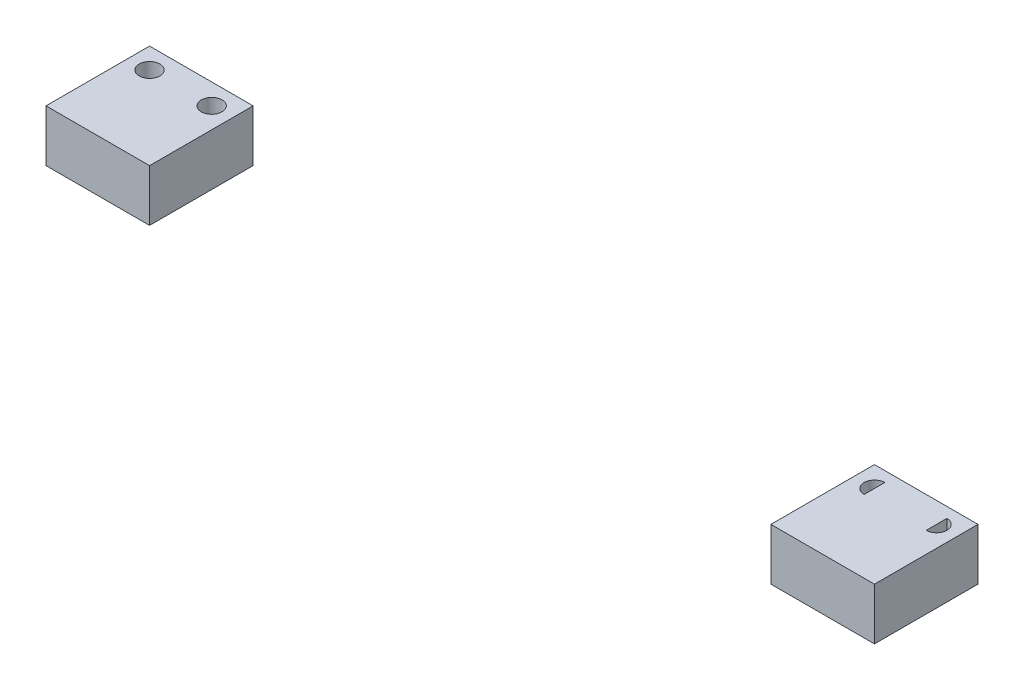
ISO-10303-21;
HEADER;
FILE_DESCRIPTION(('STEP AP214'),'2;1');
FILE_NAME('part.step','',(''),(''),'','','');
FILE_SCHEMA(('AUTOMOTIVE_DESIGN { 1 0 10303 214 1 1 1 1 }'));
ENDSEC;
DATA;
#1=APPLICATION_CONTEXT('core data for automotive mechanical design processes');
#2=APPLICATION_PROTOCOL_DEFINITION('international standard','automotive_design',2000,#1);
#3=PRODUCT_CONTEXT('',#1,'mechanical');
#4=PRODUCT('Part','Part','',(#3));
#5=PRODUCT_RELATED_PRODUCT_CATEGORY('part','',(#4));
#6=PRODUCT_DEFINITION_FORMATION('','',#4);
#7=PRODUCT_DEFINITION_CONTEXT('part definition',#1,'design');
#8=PRODUCT_DEFINITION('design','',#6,#7);
#9=PRODUCT_DEFINITION_SHAPE('','',#8);
#10=(LENGTH_UNIT() NAMED_UNIT(*) SI_UNIT(.MILLI.,.METRE.));
#11=(NAMED_UNIT(*) PLANE_ANGLE_UNIT() SI_UNIT($,.RADIAN.));
#12=(NAMED_UNIT(*) SI_UNIT($,.STERADIAN.) SOLID_ANGLE_UNIT());
#13=UNCERTAINTY_MEASURE_WITH_UNIT(LENGTH_MEASURE(1.E-05),#10,'distance_accuracy_value','');
#14=(GEOMETRIC_REPRESENTATION_CONTEXT(3) GLOBAL_UNCERTAINTY_ASSIGNED_CONTEXT((#13)) GLOBAL_UNIT_ASSIGNED_CONTEXT((#10,
#11,#12)) REPRESENTATION_CONTEXT('',''));
#15=CARTESIAN_POINT('',(0.,0.,0.));
#16=DIRECTION('',(0.,0.,1.));
#17=DIRECTION('',(1.,0.,0.));
#18=AXIS2_PLACEMENT_3D('',#15,#16,#17);
#19=CARTESIAN_POINT('',(0.,2.5,0.));
#20=DIRECTION('',(0.,1.,0.));
#21=DIRECTION('',(0.,0.,1.));
#22=AXIS2_PLACEMENT_3D('',#19,#20,#21);
#23=PLANE('',#22);
#24=DIRECTION('',(0.,0.,-1.));
#25=VECTOR('',#24,1.);
#26=CARTESIAN_POINT('',(30.,2.5,-5.));
#27=LINE('',#26,#25);
#28=CARTESIAN_POINT('',(30.,2.5,5.));
#29=VERTEX_POINT('',#28);
#30=CARTESIAN_POINT('',(30.,2.5,-5.));
#31=VERTEX_POINT('',#30);
#32=EDGE_CURVE('E141',#29,#31,#27,.T.);
#33=ORIENTED_EDGE('',*,*,#32,.F.);
#34=DIRECTION('',(-1.,0.,0.));
#35=VECTOR('',#34,1.);
#36=CARTESIAN_POINT('',(40.,2.5,5.));
#37=LINE('',#36,#35);
#38=CARTESIAN_POINT('',(40.,2.5,5.));
#39=VERTEX_POINT('',#38);
#40=EDGE_CURVE('E151',#39,#29,#37,.T.);
#41=ORIENTED_EDGE('',*,*,#40,.F.);
#42=DIRECTION('',(0.,0.,1.));
#43=VECTOR('',#42,1.);
#44=CARTESIAN_POINT('',(40.,2.5,-5.));
#45=LINE('',#44,#43);
#46=CARTESIAN_POINT('',(40.,2.5,-5.));
#47=VERTEX_POINT('',#46);
#48=EDGE_CURVE('E148',#47,#39,#45,.T.);
#49=ORIENTED_EDGE('',*,*,#48,.F.);
#50=DIRECTION('',(1.,0.,0.));
#51=VECTOR('',#50,1.);
#52=CARTESIAN_POINT('',(40.,2.5,-5.));
#53=LINE('',#52,#51);
#54=EDGE_CURVE('E144',#31,#47,#53,.T.);
#55=ORIENTED_EDGE('',*,*,#54,.F.);
#56=EDGE_LOOP('',(#33,#41,#49,#55));
#57=FACE_BOUND('',#56,.T.);
#58=CARTESIAN_POINT('',(32.,2.5,-3.));
#59=DIRECTION('',(0.,1.,0.));
#60=DIRECTION('',(0.,0.,-1.));
#61=AXIS2_PLACEMENT_3D('',#58,#59,#60);
#62=CIRCLE('',#61,1.);
#63=CARTESIAN_POINT('',(32.,2.5,-4.));
#64=VERTEX_POINT('',#63);
#65=CARTESIAN_POINT('',(32.,2.5,-2.));
#66=VERTEX_POINT('',#65);
#67=EDGE_CURVE('E123',#64,#66,#62,.T.);
#68=ORIENTED_EDGE('',*,*,#67,.F.);
#69=DIRECTION('',(0.,0.,-1.));
#70=VECTOR('',#69,1.);
#71=CARTESIAN_POINT('',(32.,2.5,-4.));
#72=LINE('',#71,#70);
#73=EDGE_CURVE('E129',#66,#64,#72,.T.);
#74=ORIENTED_EDGE('',*,*,#73,.F.);
#75=EDGE_LOOP('',(#68,#74));
#76=FACE_BOUND('',#75,.T.);
#77=DIRECTION('',(0.,0.,-1.));
#78=VECTOR('',#77,1.);
#79=CARTESIAN_POINT('',(38.,2.5,-4.));
#80=LINE('',#79,#78);
#81=CARTESIAN_POINT('',(38.,2.5,-2.));
#82=VERTEX_POINT('',#81);
#83=CARTESIAN_POINT('',(38.,2.5,-4.));
#84=VERTEX_POINT('',#83);
#85=EDGE_CURVE('E118',#82,#84,#80,.T.);
#86=ORIENTED_EDGE('',*,*,#85,.T.);
#87=CARTESIAN_POINT('',(38.,2.5,-3.));
#88=DIRECTION('',(0.,-1.,0.));
#89=DIRECTION('',(0.,0.,-1.));
#90=AXIS2_PLACEMENT_3D('',#87,#88,#89);
#91=CIRCLE('',#90,1.);
#92=EDGE_CURVE('E58',#84,#82,#91,.T.);
#93=ORIENTED_EDGE('',*,*,#92,.T.);
#94=EDGE_LOOP('',(#86,#93));
#95=FACE_BOUND('',#94,.T.);
#96=ADVANCED_FACE('F43',(#57,#76,#95),#23,.T.);
#97=CARTESIAN_POINT('',(0.,-2.5,0.));
#98=DIRECTION('',(0.,1.,0.));
#99=DIRECTION('',(0.,0.,1.));
#100=AXIS2_PLACEMENT_3D('',#97,#98,#99);
#101=PLANE('',#100);
#102=DIRECTION('',(0.,0.,-1.));
#103=VECTOR('',#102,1.);
#104=CARTESIAN_POINT('',(30.,-2.5,-5.));
#105=LINE('',#104,#103);
#106=CARTESIAN_POINT('',(30.,-2.5,5.));
#107=VERTEX_POINT('',#106);
#108=CARTESIAN_POINT('',(30.,-2.5,-5.));
#109=VERTEX_POINT('',#108);
#110=EDGE_CURVE('E138',#107,#109,#105,.T.);
#111=ORIENTED_EDGE('',*,*,#110,.T.);
#112=DIRECTION('',(1.,0.,0.));
#113=VECTOR('',#112,1.);
#114=CARTESIAN_POINT('',(40.,-2.5,-5.));
#115=LINE('',#114,#113);
#116=CARTESIAN_POINT('',(40.,-2.5,-5.));
#117=VERTEX_POINT('',#116);
#118=EDGE_CURVE('E156',#109,#117,#115,.T.);
#119=ORIENTED_EDGE('',*,*,#118,.T.);
#120=DIRECTION('',(0.,0.,1.));
#121=VECTOR('',#120,1.);
#122=CARTESIAN_POINT('',(40.,-2.5,-5.));
#123=LINE('',#122,#121);
#124=CARTESIAN_POINT('',(40.,-2.5,5.));
#125=VERTEX_POINT('',#124);
#126=EDGE_CURVE('E159',#117,#125,#123,.T.);
#127=ORIENTED_EDGE('',*,*,#126,.T.);
#128=DIRECTION('',(-1.,0.,0.));
#129=VECTOR('',#128,1.);
#130=CARTESIAN_POINT('',(40.,-2.5,5.));
#131=LINE('',#130,#129);
#132=EDGE_CURVE('E145',#125,#107,#131,.T.);
#133=ORIENTED_EDGE('',*,*,#132,.T.);
#134=EDGE_LOOP('',(#111,#119,#127,#133));
#135=FACE_BOUND('',#134,.T.);
#136=DIRECTION('',(0.,0.,-1.));
#137=VECTOR('',#136,1.);
#138=CARTESIAN_POINT('',(32.,-2.5,-4.));
#139=LINE('',#138,#137);
#140=CARTESIAN_POINT('',(32.,-2.5,-2.));
#141=VERTEX_POINT('',#140);
#142=CARTESIAN_POINT('',(32.,-2.5,-4.));
#143=VERTEX_POINT('',#142);
#144=EDGE_CURVE('E128',#141,#143,#139,.T.);
#145=ORIENTED_EDGE('',*,*,#144,.T.);
#146=CARTESIAN_POINT('',(32.,-2.5,-3.));
#147=DIRECTION('',(0.,1.,0.));
#148=DIRECTION('',(0.,0.,-1.));
#149=AXIS2_PLACEMENT_3D('',#146,#147,#148);
#150=CIRCLE('',#149,1.);
#151=EDGE_CURVE('E125',#143,#141,#150,.T.);
#152=ORIENTED_EDGE('',*,*,#151,.T.);
#153=EDGE_LOOP('',(#145,#152));
#154=FACE_BOUND('',#153,.T.);
#155=CARTESIAN_POINT('',(38.,-2.5,-3.));
#156=DIRECTION('',(0.,-1.,0.));
#157=DIRECTION('',(0.,0.,-1.));
#158=AXIS2_PLACEMENT_3D('',#155,#156,#157);
#159=CIRCLE('',#158,1.);
#160=CARTESIAN_POINT('',(38.,-2.5,-4.));
#161=VERTEX_POINT('',#160);
#162=CARTESIAN_POINT('',(38.,-2.5,-2.));
#163=VERTEX_POINT('',#162);
#164=EDGE_CURVE('E113',#161,#163,#159,.T.);
#165=ORIENTED_EDGE('',*,*,#164,.F.);
#166=DIRECTION('',(0.,0.,-1.));
#167=VECTOR('',#166,1.);
#168=CARTESIAN_POINT('',(38.,-2.5,-4.));
#169=LINE('',#168,#167);
#170=EDGE_CURVE('E107',#163,#161,#169,.T.);
#171=ORIENTED_EDGE('',*,*,#170,.F.);
#172=EDGE_LOOP('',(#165,#171));
#173=FACE_BOUND('',#172,.T.);
#174=ADVANCED_FACE('F117',(#135,#154,#173),#101,.F.);
#175=CARTESIAN_POINT('',(30.,2.5,-5.));
#176=DIRECTION('',(1.,0.,0.));
#177=DIRECTION('',(0.,0.,1.));
#178=AXIS2_PLACEMENT_3D('',#175,#176,#177);
#179=PLANE('',#178);
#180=ORIENTED_EDGE('',*,*,#110,.F.);
#181=DIRECTION('',(0.,-1.,0.));
#182=VECTOR('',#181,1.);
#183=CARTESIAN_POINT('',(30.,2.5,5.));
#184=LINE('',#183,#182);
#185=EDGE_CURVE('E153',#29,#107,#184,.T.);
#186=ORIENTED_EDGE('',*,*,#185,.F.);
#187=ORIENTED_EDGE('',*,*,#32,.T.);
#188=DIRECTION('',(0.,-1.,0.));
#189=VECTOR('',#188,1.);
#190=CARTESIAN_POINT('',(30.,2.5,-5.));
#191=LINE('',#190,#189);
#192=EDGE_CURVE('E12',#31,#109,#191,.T.);
#193=ORIENTED_EDGE('',*,*,#192,.T.);
#194=EDGE_LOOP('',(#180,#186,#187,#193));
#195=FACE_BOUND('',#194,.T.);
#196=ADVANCED_FACE('F45',(#195),#179,.F.);
#197=CARTESIAN_POINT('',(40.,2.5,-5.));
#198=DIRECTION('',(0.,0.,1.));
#199=DIRECTION('',(-1.,0.,0.));
#200=AXIS2_PLACEMENT_3D('',#197,#198,#199);
#201=PLANE('',#200);
#202=ORIENTED_EDGE('',*,*,#118,.F.);
#203=ORIENTED_EDGE('',*,*,#192,.F.);
#204=ORIENTED_EDGE('',*,*,#54,.T.);
#205=DIRECTION('',(0.,-1.,0.));
#206=VECTOR('',#205,1.);
#207=CARTESIAN_POINT('',(40.,2.5,-5.));
#208=LINE('',#207,#206);
#209=EDGE_CURVE('E51',#47,#117,#208,.T.);
#210=ORIENTED_EDGE('',*,*,#209,.T.);
#211=EDGE_LOOP('',(#202,#203,#204,#210));
#212=FACE_BOUND('',#211,.T.);
#213=ADVANCED_FACE('F170',(#212),#201,.F.);
#214=CARTESIAN_POINT('',(40.,2.5,-5.));
#215=DIRECTION('',(-1.,0.,0.));
#216=DIRECTION('',(0.,0.,-1.));
#217=AXIS2_PLACEMENT_3D('',#214,#215,#216);
#218=PLANE('',#217);
#219=ORIENTED_EDGE('',*,*,#126,.F.);
#220=ORIENTED_EDGE('',*,*,#209,.F.);
#221=ORIENTED_EDGE('',*,*,#48,.T.);
#222=DIRECTION('',(0.,-1.,0.));
#223=VECTOR('',#222,1.);
#224=CARTESIAN_POINT('',(40.,2.5,5.));
#225=LINE('',#224,#223);
#226=EDGE_CURVE('E165',#39,#125,#225,.T.);
#227=ORIENTED_EDGE('',*,*,#226,.T.);
#228=EDGE_LOOP('',(#219,#220,#221,#227));
#229=FACE_BOUND('',#228,.T.);
#230=ADVANCED_FACE('F182',(#229),#218,.F.);
#231=CARTESIAN_POINT('',(40.,2.5,5.));
#232=DIRECTION('',(0.,0.,-1.));
#233=DIRECTION('',(1.,0.,0.));
#234=AXIS2_PLACEMENT_3D('',#231,#232,#233);
#235=PLANE('',#234);
#236=ORIENTED_EDGE('',*,*,#132,.F.);
#237=ORIENTED_EDGE('',*,*,#226,.F.);
#238=ORIENTED_EDGE('',*,*,#40,.T.);
#239=ORIENTED_EDGE('',*,*,#185,.T.);
#240=EDGE_LOOP('',(#236,#237,#238,#239));
#241=FACE_BOUND('',#240,.T.);
#242=ADVANCED_FACE('F184',(#241),#235,.F.);
#243=CARTESIAN_POINT('',(32.,-2.5,-3.));
#244=DIRECTION('',(0.,1.,0.));
#245=DIRECTION('',(0.,0.,1.));
#246=AXIS2_PLACEMENT_3D('',#243,#244,#245);
#247=CYLINDRICAL_SURFACE('',#246,1.);
#248=ORIENTED_EDGE('',*,*,#67,.T.);
#249=DIRECTION('',(0.,1.,0.));
#250=VECTOR('',#249,1.);
#251=CARTESIAN_POINT('',(32.,-2.5,-2.));
#252=LINE('',#251,#250);
#253=EDGE_CURVE('E132',#141,#66,#252,.T.);
#254=ORIENTED_EDGE('',*,*,#253,.F.);
#255=ORIENTED_EDGE('',*,*,#151,.F.);
#256=DIRECTION('',(0.,1.,0.));
#257=VECTOR('',#256,1.);
#258=CARTESIAN_POINT('',(32.,-2.5,-4.));
#259=LINE('',#258,#257);
#260=EDGE_CURVE('E136',#143,#64,#259,.T.);
#261=ORIENTED_EDGE('',*,*,#260,.T.);
#262=EDGE_LOOP('',(#248,#254,#255,#261));
#263=FACE_BOUND('',#262,.T.);
#264=ADVANCED_FACE('F186',(#263),#247,.F.);
#265=CARTESIAN_POINT('',(32.,-2.5,-4.));
#266=DIRECTION('',(1.,0.,0.));
#267=DIRECTION('',(0.,0.,-1.));
#268=AXIS2_PLACEMENT_3D('',#265,#266,#267);
#269=PLANE('',#268);
#270=ORIENTED_EDGE('',*,*,#73,.T.);
#271=ORIENTED_EDGE('',*,*,#260,.F.);
#272=ORIENTED_EDGE('',*,*,#144,.F.);
#273=ORIENTED_EDGE('',*,*,#253,.T.);
#274=EDGE_LOOP('',(#270,#271,#272,#273));
#275=FACE_BOUND('',#274,.T.);
#276=ADVANCED_FACE('F193',(#275),#269,.F.);
#277=CARTESIAN_POINT('',(38.,-2.5,-3.));
#278=DIRECTION('',(0.,1.,0.));
#279=DIRECTION('',(0.,0.,1.));
#280=AXIS2_PLACEMENT_3D('',#277,#278,#279);
#281=CYLINDRICAL_SURFACE('',#280,1.);
#282=ORIENTED_EDGE('',*,*,#92,.F.);
#283=DIRECTION('',(0.,1.,0.));
#284=VECTOR('',#283,1.);
#285=CARTESIAN_POINT('',(38.,-2.5,-4.));
#286=LINE('',#285,#284);
#287=EDGE_CURVE('E109',#161,#84,#286,.T.);
#288=ORIENTED_EDGE('',*,*,#287,.F.);
#289=ORIENTED_EDGE('',*,*,#164,.T.);
#290=DIRECTION('',(0.,1.,0.));
#291=VECTOR('',#290,1.);
#292=CARTESIAN_POINT('',(38.,-2.5,-2.));
#293=LINE('',#292,#291);
#294=EDGE_CURVE('E65',#163,#82,#293,.T.);
#295=ORIENTED_EDGE('',*,*,#294,.T.);
#296=EDGE_LOOP('',(#282,#288,#289,#295));
#297=FACE_BOUND('',#296,.T.);
#298=ADVANCED_FACE('F115',(#297),#281,.F.);
#299=CARTESIAN_POINT('',(38.,-2.5,-4.));
#300=DIRECTION('',(1.,0.,0.));
#301=DIRECTION('',(0.,0.,-1.));
#302=AXIS2_PLACEMENT_3D('',#299,#300,#301);
#303=PLANE('',#302);
#304=ORIENTED_EDGE('',*,*,#85,.F.);
#305=ORIENTED_EDGE('',*,*,#294,.F.);
#306=ORIENTED_EDGE('',*,*,#170,.T.);
#307=ORIENTED_EDGE('',*,*,#287,.T.);
#308=EDGE_LOOP('',(#304,#305,#306,#307));
#309=FACE_BOUND('',#308,.T.);
#310=ADVANCED_FACE('F108',(#309),#303,.T.);
#311=CLOSED_SHELL('',(#96,#174,#196,#213,#230,#242,#264,#276,#298,#310));
#312=MANIFOLD_SOLID_BREP('B2',#311);
#313=CARTESIAN_POINT('',(0.,2.5,0.));
#314=DIRECTION('',(0.,1.,0.));
#315=DIRECTION('',(0.,0.,1.));
#316=AXIS2_PLACEMENT_3D('',#313,#314,#315);
#317=PLANE('',#316);
#318=DIRECTION('',(0.,0.,-1.));
#319=VECTOR('',#318,1.);
#320=CARTESIAN_POINT('',(-30.,2.5,-5.));
#321=LINE('',#320,#319);
#322=CARTESIAN_POINT('',(-30.,2.5,5.));
#323=VERTEX_POINT('',#322);
#324=CARTESIAN_POINT('',(-30.,2.5,-5.));
#325=VERTEX_POINT('',#324);
#326=EDGE_CURVE('E326',#323,#325,#321,.T.);
#327=ORIENTED_EDGE('',*,*,#326,.T.);
#328=DIRECTION('',(-1.,0.,0.));
#329=VECTOR('',#328,1.);
#330=CARTESIAN_POINT('',(-40.,2.5,-5.));
#331=LINE('',#330,#329);
#332=CARTESIAN_POINT('',(-40.,2.5,-5.));
#333=VERTEX_POINT('',#332);
#334=EDGE_CURVE('E321',#325,#333,#331,.T.);
#335=ORIENTED_EDGE('',*,*,#334,.T.);
#336=DIRECTION('',(0.,0.,1.));
#337=VECTOR('',#336,1.);
#338=CARTESIAN_POINT('',(-40.,2.5,-5.));
#339=LINE('',#338,#337);
#340=CARTESIAN_POINT('',(-40.,2.5,5.));
#341=VERTEX_POINT('',#340);
#342=EDGE_CURVE('E324',#333,#341,#339,.T.);
#343=ORIENTED_EDGE('',*,*,#342,.T.);
#344=DIRECTION('',(1.,0.,0.));
#345=VECTOR('',#344,1.);
#346=CARTESIAN_POINT('',(-40.,2.5,5.));
#347=LINE('',#346,#345);
#348=EDGE_CURVE('E291',#341,#323,#347,.T.);
#349=ORIENTED_EDGE('',*,*,#348,.T.);
#350=EDGE_LOOP('',(#327,#335,#343,#349));
#351=FACE_BOUND('',#350,.T.);
#352=CARTESIAN_POINT('',(-38.,2.5,-3.));
#353=DIRECTION('',(0.,1.,0.));
#354=DIRECTION('',(0.,0.,1.));
#355=AXIS2_PLACEMENT_3D('',#352,#353,#354);
#356=CIRCLE('',#355,0.999999999999998);
#357=CARTESIAN_POINT('',(-38.,2.5,-2.));
#358=VERTEX_POINT('',#357);
#359=EDGE_CURVE('E353',#358,#358,#356,.T.);
#360=ORIENTED_EDGE('',*,*,#359,.F.);
#361=EDGE_LOOP('',(#360));
#362=FACE_BOUND('',#361,.T.);
#363=CARTESIAN_POINT('',(-32.,2.5,-3.));
#364=DIRECTION('',(0.,-1.,0.));
#365=DIRECTION('',(0.,0.,1.));
#366=AXIS2_PLACEMENT_3D('',#363,#364,#365);
#367=CIRCLE('',#366,0.999999999999998);
#368=CARTESIAN_POINT('',(-32.,2.5,-2.));
#369=VERTEX_POINT('',#368);
#370=EDGE_CURVE('E359',#369,#369,#367,.T.);
#371=ORIENTED_EDGE('',*,*,#370,.T.);
#372=EDGE_LOOP('',(#371));
#373=FACE_BOUND('',#372,.T.);
#374=ADVANCED_FACE('F274',(#351,#362,#373),#317,.T.);
#375=CARTESIAN_POINT('',(0.,-2.5,0.));
#376=DIRECTION('',(0.,1.,0.));
#377=DIRECTION('',(0.,0.,1.));
#378=AXIS2_PLACEMENT_3D('',#375,#376,#377);
#379=PLANE('',#378);
#380=DIRECTION('',(0.,0.,-1.));
#381=VECTOR('',#380,1.);
#382=CARTESIAN_POINT('',(-30.,-2.5,-5.));
#383=LINE('',#382,#381);
#384=CARTESIAN_POINT('',(-30.,-2.5,5.));
#385=VERTEX_POINT('',#384);
#386=CARTESIAN_POINT('',(-30.,-2.5,-5.));
#387=VERTEX_POINT('',#386);
#388=EDGE_CURVE('E338',#385,#387,#383,.T.);
#389=ORIENTED_EDGE('',*,*,#388,.F.);
#390=DIRECTION('',(1.,0.,0.));
#391=VECTOR('',#390,1.);
#392=CARTESIAN_POINT('',(-40.,-2.5,5.));
#393=LINE('',#392,#391);
#394=CARTESIAN_POINT('',(-40.,-2.5,5.));
#395=VERTEX_POINT('',#394);
#396=EDGE_CURVE('E314',#395,#385,#393,.T.);
#397=ORIENTED_EDGE('',*,*,#396,.F.);
#398=DIRECTION('',(0.,0.,1.));
#399=VECTOR('',#398,1.);
#400=CARTESIAN_POINT('',(-40.,-2.5,-5.));
#401=LINE('',#400,#399);
#402=CARTESIAN_POINT('',(-40.,-2.5,-5.));
#403=VERTEX_POINT('',#402);
#404=EDGE_CURVE('E308',#403,#395,#401,.T.);
#405=ORIENTED_EDGE('',*,*,#404,.F.);
#406=DIRECTION('',(-1.,0.,0.));
#407=VECTOR('',#406,1.);
#408=CARTESIAN_POINT('',(-40.,-2.5,-5.));
#409=LINE('',#408,#407);
#410=EDGE_CURVE('E330',#387,#403,#409,.T.);
#411=ORIENTED_EDGE('',*,*,#410,.F.);
#412=EDGE_LOOP('',(#389,#397,#405,#411));
#413=FACE_BOUND('',#412,.T.);
#414=CARTESIAN_POINT('',(-38.,-2.5,-3.));
#415=DIRECTION('',(0.,1.,0.));
#416=DIRECTION('',(0.,0.,1.));
#417=AXIS2_PLACEMENT_3D('',#414,#415,#416);
#418=CIRCLE('',#417,0.999999999999998);
#419=CARTESIAN_POINT('',(-38.,-2.5,-2.));
#420=VERTEX_POINT('',#419);
#421=EDGE_CURVE('E341',#420,#420,#418,.T.);
#422=ORIENTED_EDGE('',*,*,#421,.T.);
#423=EDGE_LOOP('',(#422));
#424=FACE_BOUND('',#423,.T.);
#425=CARTESIAN_POINT('',(-32.,-2.5,-3.));
#426=DIRECTION('',(0.,-1.,0.));
#427=DIRECTION('',(0.,0.,1.));
#428=AXIS2_PLACEMENT_3D('',#425,#426,#427);
#429=CIRCLE('',#428,0.999999999999998);
#430=CARTESIAN_POINT('',(-32.,-2.5,-2.));
#431=VERTEX_POINT('',#430);
#432=EDGE_CURVE('E356',#431,#431,#429,.T.);
#433=ORIENTED_EDGE('',*,*,#432,.F.);
#434=EDGE_LOOP('',(#433));
#435=FACE_BOUND('',#434,.T.);
#436=ADVANCED_FACE('F349',(#413,#424,#435),#379,.F.);
#437=CARTESIAN_POINT('',(-30.,2.5,-5.));
#438=DIRECTION('',(-1.,0.,0.));
#439=DIRECTION('',(0.,0.,1.));
#440=AXIS2_PLACEMENT_3D('',#437,#438,#439);
#441=PLANE('',#440);
#442=ORIENTED_EDGE('',*,*,#388,.T.);
#443=DIRECTION('',(0.,-1.,0.));
#444=VECTOR('',#443,1.);
#445=CARTESIAN_POINT('',(-30.,2.5,-5.));
#446=LINE('',#445,#444);
#447=EDGE_CURVE('E41',#325,#387,#446,.T.);
#448=ORIENTED_EDGE('',*,*,#447,.F.);
#449=ORIENTED_EDGE('',*,*,#326,.F.);
#450=DIRECTION('',(0.,-1.,0.));
#451=VECTOR('',#450,1.);
#452=CARTESIAN_POINT('',(-30.,2.5,5.));
#453=LINE('',#452,#451);
#454=EDGE_CURVE('E334',#323,#385,#453,.T.);
#455=ORIENTED_EDGE('',*,*,#454,.T.);
#456=EDGE_LOOP('',(#442,#448,#449,#455));
#457=FACE_BOUND('',#456,.T.);
#458=ADVANCED_FACE('F276',(#457),#441,.F.);
#459=CARTESIAN_POINT('',(-40.,2.5,-5.));
#460=DIRECTION('',(0.,0.,1.));
#461=DIRECTION('',(1.,0.,0.));
#462=AXIS2_PLACEMENT_3D('',#459,#460,#461);
#463=PLANE('',#462);
#464=ORIENTED_EDGE('',*,*,#410,.T.);
#465=DIRECTION('',(0.,-1.,0.));
#466=VECTOR('',#465,1.);
#467=CARTESIAN_POINT('',(-40.,2.5,-5.));
#468=LINE('',#467,#466);
#469=EDGE_CURVE('E283',#333,#403,#468,.T.);
#470=ORIENTED_EDGE('',*,*,#469,.F.);
#471=ORIENTED_EDGE('',*,*,#334,.F.);
#472=ORIENTED_EDGE('',*,*,#447,.T.);
#473=EDGE_LOOP('',(#464,#470,#471,#472));
#474=FACE_BOUND('',#473,.T.);
#475=ADVANCED_FACE('F329',(#474),#463,.F.);
#476=CARTESIAN_POINT('',(-40.,2.5,-5.));
#477=DIRECTION('',(1.,0.,0.));
#478=DIRECTION('',(0.,0.,-1.));
#479=AXIS2_PLACEMENT_3D('',#476,#477,#478);
#480=PLANE('',#479);
#481=ORIENTED_EDGE('',*,*,#404,.T.);
#482=DIRECTION('',(0.,-1.,0.));
#483=VECTOR('',#482,1.);
#484=CARTESIAN_POINT('',(-40.,2.5,5.));
#485=LINE('',#484,#483);
#486=EDGE_CURVE('E331',#341,#395,#485,.T.);
#487=ORIENTED_EDGE('',*,*,#486,.F.);
#488=ORIENTED_EDGE('',*,*,#342,.F.);
#489=ORIENTED_EDGE('',*,*,#469,.T.);
#490=EDGE_LOOP('',(#481,#487,#488,#489));
#491=FACE_BOUND('',#490,.T.);
#492=ADVANCED_FACE('F332',(#491),#480,.F.);
#493=CARTESIAN_POINT('',(-40.,2.5,5.));
#494=DIRECTION('',(0.,0.,-1.));
#495=DIRECTION('',(-1.,0.,0.));
#496=AXIS2_PLACEMENT_3D('',#493,#494,#495);
#497=PLANE('',#496);
#498=ORIENTED_EDGE('',*,*,#396,.T.);
#499=ORIENTED_EDGE('',*,*,#454,.F.);
#500=ORIENTED_EDGE('',*,*,#348,.F.);
#501=ORIENTED_EDGE('',*,*,#486,.T.);
#502=EDGE_LOOP('',(#498,#499,#500,#501));
#503=FACE_BOUND('',#502,.T.);
#504=ADVANCED_FACE('F346',(#503),#497,.F.);
#505=CARTESIAN_POINT('',(-38.,-2.5,-3.));
#506=DIRECTION('',(0.,1.,0.));
#507=DIRECTION('',(0.,0.,1.));
#508=AXIS2_PLACEMENT_3D('',#505,#506,#507);
#509=CYLINDRICAL_SURFACE('',#508,0.999999999999998);
#510=ORIENTED_EDGE('',*,*,#421,.F.);
#511=EDGE_LOOP('',(#510));
#512=FACE_BOUND('',#511,.T.);
#513=ORIENTED_EDGE('',*,*,#359,.T.);
#514=EDGE_LOOP('',(#513));
#515=FACE_BOUND('',#514,.T.);
#516=ADVANCED_FACE('F380',(#512,#515),#509,.F.);
#517=CARTESIAN_POINT('',(-32.,-2.5,-3.));
#518=DIRECTION('',(0.,1.,0.));
#519=DIRECTION('',(0.,0.,1.));
#520=AXIS2_PLACEMENT_3D('',#517,#518,#519);
#521=CYLINDRICAL_SURFACE('',#520,0.999999999999998);
#522=ORIENTED_EDGE('',*,*,#432,.T.);
#523=EDGE_LOOP('',(#522));
#524=FACE_BOUND('',#523,.T.);
#525=ORIENTED_EDGE('',*,*,#370,.F.);
#526=EDGE_LOOP('',(#525));
#527=FACE_BOUND('',#526,.T.);
#528=ADVANCED_FACE('F365',(#524,#527),#521,.F.);
#529=CLOSED_SHELL('',(#374,#436,#458,#475,#492,#504,#516,#528));
#530=MANIFOLD_SOLID_BREP('B6',#529);
#531=ADVANCED_BREP_SHAPE_REPRESENTATION('',(#18,#312,#530),#14);
#532=SHAPE_DEFINITION_REPRESENTATION(#9,#531);
ENDSEC;
END-ISO-10303-21;
